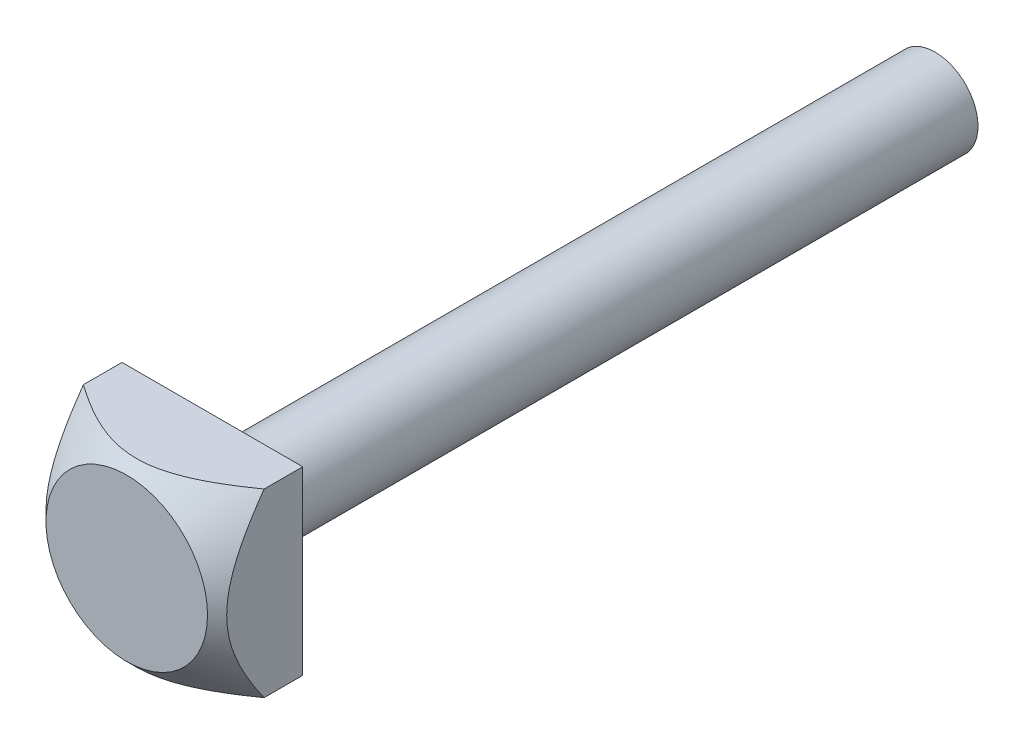
ISO-10303-21;
HEADER;
FILE_DESCRIPTION(('STEP AP214'),'2;1');
FILE_NAME('part.step','',(''),(''),'','','');
FILE_SCHEMA(('AUTOMOTIVE_DESIGN { 1 0 10303 214 1 1 1 1 }'));
ENDSEC;
DATA;
#1=APPLICATION_CONTEXT('core data for automotive mechanical design processes');
#2=APPLICATION_PROTOCOL_DEFINITION('international standard','automotive_design',2000,#1);
#3=PRODUCT_CONTEXT('',#1,'mechanical');
#4=PRODUCT('Part','Part','',(#3));
#5=PRODUCT_RELATED_PRODUCT_CATEGORY('part','',(#4));
#6=PRODUCT_DEFINITION_FORMATION('','',#4);
#7=PRODUCT_DEFINITION_CONTEXT('part definition',#1,'design');
#8=PRODUCT_DEFINITION('design','',#6,#7);
#9=PRODUCT_DEFINITION_SHAPE('','',#8);
#10=(LENGTH_UNIT() NAMED_UNIT(*) SI_UNIT(.MILLI.,.METRE.));
#11=(NAMED_UNIT(*) PLANE_ANGLE_UNIT() SI_UNIT($,.RADIAN.));
#12=(NAMED_UNIT(*) SI_UNIT($,.STERADIAN.) SOLID_ANGLE_UNIT());
#13=UNCERTAINTY_MEASURE_WITH_UNIT(LENGTH_MEASURE(1.E-05),#10,'distance_accuracy_value','');
#14=(GEOMETRIC_REPRESENTATION_CONTEXT(3) GLOBAL_UNCERTAINTY_ASSIGNED_CONTEXT((#13)) GLOBAL_UNIT_ASSIGNED_CONTEXT((#10,
#11,#12)) REPRESENTATION_CONTEXT('',''));
#15=CARTESIAN_POINT('',(0.,0.,0.));
#16=DIRECTION('',(0.,0.,1.));
#17=DIRECTION('',(1.,0.,0.));
#18=AXIS2_PLACEMENT_3D('',#15,#16,#17);
#19=CARTESIAN_POINT('',(9.5,9.5,9.));
#20=DIRECTION('',(-1.,0.,0.));
#21=DIRECTION('',(0.,-1.,0.));
#22=AXIS2_PLACEMENT_3D('',#19,#20,#21);
#23=PLANE('',#22);
#24=CARTESIAN_POINT('',(9.50000000000001,-20.0417212673577,-4.68636817389557));
#25=CARTESIAN_POINT('',(9.50000000000001,-19.5923730732626,-4.28037837364364));
#26=CARTESIAN_POINT('',(9.50000000000001,-19.1418237299608,-3.87570858413714));
#27=CARTESIAN_POINT('',(9.50000000000001,-18.2376978651878,-3.06969887886567));
#28=CARTESIAN_POINT('',(9.50000000000001,-17.7841211215472,-2.66835921244345));
#29=CARTESIAN_POINT('',(9.50000000000001,-16.8720031883656,-1.86855095707584));
#30=CARTESIAN_POINT('',(9.50000000000001,-16.4134511250011,-1.47009474209597));
#31=CARTESIAN_POINT('',(9.50000000000001,-15.7223155615848,-0.876280826702846));
#32=CARTESIAN_POINT('',(9.50000000000001,-15.4913906384999,-0.678991990434979));
#33=CARTESIAN_POINT('',(9.50000000000001,-15.0283016212763,-0.285861598052675));
#34=CARTESIAN_POINT('',(9.50000000000001,-14.7961374940735,-0.0900200808912309));
#35=CARTESIAN_POINT('',(9.50000000000001,-14.0710011341802,0.517328398598816));
#36=CARTESIAN_POINT('',(9.50000000000001,-13.5756516886263,0.926006598518927));
#37=CARTESIAN_POINT('',(9.50000000000001,-12.5772092371001,1.73379416928092));
#38=CARTESIAN_POINT('',(9.50000000000001,-12.0741165880928,2.13290397907304));
#39=CARTESIAN_POINT('',(9.50000000000001,-11.3122650680949,2.72160569149936));
#40=CARTESIAN_POINT('',(9.50000000000001,-11.0572669833382,2.91606587317929));
#41=CARTESIAN_POINT('',(9.50000000000001,-10.5444051579691,3.30116549587683));
#42=CARTESIAN_POINT('',(9.50000000000001,-10.2865414826739,3.49180502370452));
#43=CARTESIAN_POINT('',(9.50000000000001,-9.76757685769606,3.86853513115214));
#44=CARTESIAN_POINT('',(9.50000000000001,-9.50647649051677,4.05462651188485));
#45=CARTESIAN_POINT('',(9.50000000000001,-8.98051949311415,4.42141197260792));
#46=CARTESIAN_POINT('',(9.50000000000001,-8.71566305074137,4.60210632112299));
#47=CARTESIAN_POINT('',(9.50000000000001,-8.23865203650719,4.91910122285019));
#48=CARTESIAN_POINT('',(9.50000000000001,-8.02732198236332,5.05664143538501));
#49=CARTESIAN_POINT('',(9.50000000000001,-7.60167924408506,5.32704021975822));
#50=CARTESIAN_POINT('',(9.50000000000001,-7.38736654747647,5.45989877200845));
#51=CARTESIAN_POINT('',(9.50000000000001,-6.95531735478461,5.72020492974797));
#52=CARTESIAN_POINT('',(9.50000000000001,-6.73757912857458,5.84764967226628));
#53=CARTESIAN_POINT('',(9.50000000000001,-6.29844740802339,6.09608818753819));
#54=CARTESIAN_POINT('',(9.50000000000001,-6.07705394925149,6.2170820230175));
#55=CARTESIAN_POINT('',(9.50000000000001,-5.63229743444904,6.45039390905836));
#56=CARTESIAN_POINT('',(9.50000000000001,-5.40897105047448,6.56278133602902));
#57=CARTESIAN_POINT('',(9.50000000000001,-4.95810958542703,6.77873343132443));
#58=CARTESIAN_POINT('',(9.5,-4.73057426954477,6.88229760559672));
#59=CARTESIAN_POINT('',(9.5,-4.04160428518241,7.17727645788981));
#60=CARTESIAN_POINT('',(9.5,-3.57324034393485,7.35328242334376));
#61=CARTESIAN_POINT('',(9.5,-2.81453367769527,7.58837087773008));
#62=CARTESIAN_POINT('',(9.5,-2.52985209976433,7.66581629419068));
#63=CARTESIAN_POINT('',(9.5,-1.95517851196994,7.79783353852228));
#64=CARTESIAN_POINT('',(9.5,-1.66518733338838,7.85240891554878));
#65=CARTESIAN_POINT('',(9.5,-1.08259026026116,7.93575719935647));
#66=CARTESIAN_POINT('',(9.5,-0.789998430807787,7.96462706005755));
#67=CARTESIAN_POINT('',(9.5,-0.203379047593805,7.99525178751732));
#68=CARTESIAN_POINT('',(9.5,0.0906484734933177,7.99700726849478));
#69=CARTESIAN_POINT('',(9.5,0.677646174202131,7.97329499537613));
#70=CARTESIAN_POINT('',(9.5,0.970616117628069,7.94782149695403));
#71=CARTESIAN_POINT('',(9.5,1.55313441508035,7.87112729305192));
#72=CARTESIAN_POINT('',(9.5,1.84268248312107,7.81990445091141));
#73=CARTESIAN_POINT('',(9.5,2.41794523834898,7.69407496321651));
#74=CARTESIAN_POINT('',(9.5,2.70363683115422,7.61936419609721));
#75=CARTESIAN_POINT('',(9.5,3.26892554369698,7.44985161876595));
#76=CARTESIAN_POINT('',(9.5,3.54852246051522,7.35504914073364));
#77=CARTESIAN_POINT('',(9.5,4.16080514241227,7.12637434325508));
#78=CARTESIAN_POINT('',(9.5,4.4919805219018,6.98848425549441));
#79=CARTESIAN_POINT('',(9.5,5.14544057278843,6.69288832489013));
#80=CARTESIAN_POINT('',(9.5,5.46772077689808,6.53517273854368));
#81=CARTESIAN_POINT('',(9.5,6.10468569318532,6.20384596505104));
#82=CARTESIAN_POINT('',(9.5,6.41935552402881,6.03020638777145));
#83=CARTESIAN_POINT('',(9.5,7.04144668065026,5.67058080458727));
#84=CARTESIAN_POINT('',(9.5,7.34886911068626,5.48459669626358));
#85=CARTESIAN_POINT('',(9.5,7.96181726081544,5.10006263673665));
#86=CARTESIAN_POINT('',(9.5,8.26725422846057,4.90137186866767));
#87=CARTESIAN_POINT('',(9.5,8.87266630104506,4.49584932687694));
#88=CARTESIAN_POINT('',(9.5,9.17264124242189,4.28901730994674));
#89=CARTESIAN_POINT('',(9.5,9.76758178967295,3.86898992266096));
#90=CARTESIAN_POINT('',(9.5,10.0625526889801,3.65580203211709));
#91=CARTESIAN_POINT('',(9.5,10.5020047179397,3.3319711139773));
#92=CARTESIAN_POINT('',(9.5,10.647985779558,3.22335433375976));
#93=CARTESIAN_POINT('',(9.5,10.9390211991308,3.00488713429763));
#94=CARTESIAN_POINT('',(9.5,11.0840755603428,2.89503671939321));
#95=CARTESIAN_POINT('',(9.5,11.598362388142,2.50242101659101));
#96=CARTESIAN_POINT('',(9.5,11.9652307132791,2.2165547558364));
#97=CARTESIAN_POINT('',(9.5,12.694350502993,1.63898491563494));
#98=CARTESIAN_POINT('',(9.5,13.0566017794365,1.34728109955894));
#99=CARTESIAN_POINT('',(9.5,13.7772946167739,0.759102012225014));
#100=CARTESIAN_POINT('',(9.5,14.1357356035713,0.462626038401692));
#101=CARTESIAN_POINT('',(9.5,14.8493619613434,-0.134203824340193));
#102=CARTESIAN_POINT('',(9.5,15.2045473724905,-0.43455766529728));
#103=CARTESIAN_POINT('',(9.5,15.9123357606024,-1.03863661193217));
#104=CARTESIAN_POINT('',(9.5,16.2649373974988,-1.34236328627187));
#105=CARTESIAN_POINT('',(9.5,16.9677851688788,-1.95253144930041));
#106=CARTESIAN_POINT('',(9.5,17.3180312879615,-2.25897295570917));
#107=CARTESIAN_POINT('',(9.5,18.3657602928997,-3.18173807105576));
#108=CARTESIAN_POINT('',(9.5,19.060222788712,-3.8014928086164));
#109=CARTESIAN_POINT('',(9.5,20.098133685983,-4.73685527463836));
#110=CARTESIAN_POINT('',(9.5,20.4438566470177,-5.04994992476554));
#111=CARTESIAN_POINT('',(9.5,21.1339535807354,-5.67761360105597));
#112=CARTESIAN_POINT('',(9.5,21.4783275723584,-5.99218260638169));
#113=CARTESIAN_POINT('',(9.5,22.5097003541093,-6.93782679857949));
#114=CARTESIAN_POINT('',(9.5,23.1949351600908,-7.57082580183782));
#115=CARTESIAN_POINT('',(9.5,24.5615024765893,-8.84059495628473));
#116=CARTESIAN_POINT('',(9.5,25.2428361271386,-9.47736388216803));
#117=CARTESIAN_POINT('',(9.5,26.6025435816977,-10.7540448270886));
#118=CARTESIAN_POINT('',(9.5,27.2809174016513,-11.3939568291555));
#119=CARTESIAN_POINT('',(9.5,29.1393573153453,-13.1535702066372));
#120=CARTESIAN_POINT('',(9.5,30.3169877299625,-14.2758433928479));
#121=CARTESIAN_POINT('',(9.5,32.6671742157751,-16.5258992920477));
#122=CARTESIAN_POINT('',(9.5,33.8397298081081,-17.6536825044739));
#123=CARTESIAN_POINT('',(9.5,36.1765260919345,-19.9089275817975));
#124=CARTESIAN_POINT('',(9.5,37.3407814397396,-21.0363742665459));
#125=CARTESIAN_POINT('',(9.5,39.0849191470923,-22.7297361612328));
#126=CARTESIAN_POINT('',(9.5,39.6658945154198,-23.294526503131));
#127=CARTESIAN_POINT('',(9.5,40.8271984919451,-24.4247709198994));
#128=CARTESIAN_POINT('',(9.5,41.4075271006064,-24.9902249942935));
#129=CARTESIAN_POINT('',(9.5,41.9875736026911,-25.5559683525961));
#130=B_SPLINE_CURVE_WITH_KNOTS('',3,(#24,#25,#26,#27,#28,#29,#30,#31,#32,#33,#34,#35,#36,#37,
#38,#39,#40,#41,#42,#43,#44,#45,#46,#47,#48,#49,#50,#51,#52,#53,#54,#55,#56,#57,#58,#59,#60,#61,
#62,#63,#64,#65,#66,#67,#68,#69,#70,#71,#72,#73,#74,#75,#76,#77,#78,#79,#80,#81,#82,#83,#84,#85,
#86,#87,#88,#89,#90,#91,#92,#93,#94,#95,#96,#97,#98,#99,#100,#101,#102,#103,#104,#105,#106,#107,
#108,#109,#110,#111,#112,#113,#114,#115,#116,#117,#118,#119,#120,#121,#122,#123,#124,#125,#126,
#127,#128,#129),.UNSPECIFIED.,.F.,.F.,(4,2,2,2,2,2,2,2,2,2,2,2,2,2,2,2,2,2,2,2,2,2,2,2,2,2,2,2,
2,2,2,2,2,2,2,2,2,2,2,2,2,2,2,2,2,2,2,2,2,2,2,2,4),(0.,1.81678200141745,3.63369882851048,
5.45611746694714,6.36728884188256,7.27848465132521,9.20492404637271,11.1312748961779,
12.0933013692795,13.0553059590875,14.0171398615981,14.9789258288997,15.7353129435926,
16.4917032226469,17.2484886447631,18.0052667068971,18.755105852599,19.5049869575123,
21.0028276694774,21.8871513171501,22.771337677543,23.6521748353672,24.5329920396639,
25.41399510109,26.2950712795356,27.1801096760423,28.0651774946023,29.1405364824813,
30.2164260512677,31.2942725142247,32.3719536744116,33.4649207118284,34.5579204249268,
35.6496810295647,36.1955444964398,36.7414060434657,38.1366015822194,39.53185379116,
40.9273133252106,42.3227556167144,43.7188766232182,45.1150067490308,47.9073106224418,
49.3065845922539,50.7058388449493,53.504407142721,56.3021109644898,59.0997996972599,
63.9800174665321,68.8606861113948,73.7227396728183,76.1535178905231,78.5842943657068),.UNSPECIFIED.);
#131=CARTESIAN_POINT('',(9.50000000000001,-9.5,4.05788591512609));
#132=VERTEX_POINT('',#131);
#133=CARTESIAN_POINT('',(9.5,9.5,4.05788591512609));
#134=VERTEX_POINT('',#133);
#135=EDGE_CURVE('E76',#132,#134,#130,.T.);
#136=ORIENTED_EDGE('',*,*,#135,.F.);
#137=DIRECTION('',(0.,0.,-1.));
#138=VECTOR('',#137,1.);
#139=CARTESIAN_POINT('',(9.50000000000001,-9.5,9.));
#140=LINE('',#139,#138);
#141=CARTESIAN_POINT('',(9.50000000000001,-9.5,0.));
#142=VERTEX_POINT('',#141);
#143=EDGE_CURVE('E57',#132,#142,#140,.T.);
#144=ORIENTED_EDGE('',*,*,#143,.T.);
#145=DIRECTION('',(0.,1.,0.));
#146=VECTOR('',#145,1.);
#147=CARTESIAN_POINT('',(9.5,9.5,0.));
#148=LINE('',#147,#146);
#149=CARTESIAN_POINT('',(9.5,9.5,0.));
#150=VERTEX_POINT('',#149);
#151=EDGE_CURVE('E83',#142,#150,#148,.T.);
#152=ORIENTED_EDGE('',*,*,#151,.T.);
#153=DIRECTION('',(0.,0.,-1.));
#154=VECTOR('',#153,1.);
#155=CARTESIAN_POINT('',(9.5,9.5,9.));
#156=LINE('',#155,#154);
#157=EDGE_CURVE('E42',#134,#150,#156,.T.);
#158=ORIENTED_EDGE('',*,*,#157,.F.);
#159=EDGE_LOOP('',(#136,#144,#152,#158));
#160=FACE_BOUND('',#159,.T.);
#161=ADVANCED_FACE('F34',(#160),#23,.F.);
#162=CARTESIAN_POINT('',(-9.5,9.5,9.));
#163=DIRECTION('',(0.,-1.,0.));
#164=DIRECTION('',(1.,0.,0.));
#165=AXIS2_PLACEMENT_3D('',#162,#163,#164);
#166=PLANE('',#165);
#167=CARTESIAN_POINT('',(-20.0417212673573,9.5,-4.68636817389517));
#168=CARTESIAN_POINT('',(-19.5923730732622,9.5,-4.28037837364325));
#169=CARTESIAN_POINT('',(-19.1418237299604,9.5,-3.87570858413675));
#170=CARTESIAN_POINT('',(-18.2376978651874,9.5,-3.06969887886529));
#171=CARTESIAN_POINT('',(-17.7841211215468,9.5,-2.66835921244308));
#172=CARTESIAN_POINT('',(-16.8720031883652,9.5,-1.86855095707549));
#173=CARTESIAN_POINT('',(-16.4134511250007,9.5,-1.47009474209563));
#174=CARTESIAN_POINT('',(-15.7223155615844,9.5,-0.876280826702511));
#175=CARTESIAN_POINT('',(-15.4913906384995,9.5,-0.678991990434647));
#176=CARTESIAN_POINT('',(-15.0283016212759,9.5,-0.28586159805235));
#177=CARTESIAN_POINT('',(-14.7961374940731,9.5,-0.0900200808909085));
#178=CARTESIAN_POINT('',(-14.0710011341798,9.5,0.517328398599129));
#179=CARTESIAN_POINT('',(-13.5756516886259,9.5,0.926006598519232));
#180=CARTESIAN_POINT('',(-12.5772092370997,9.5,1.73379416928121));
#181=CARTESIAN_POINT('',(-12.0741165880924,9.5,2.13290397907333));
#182=CARTESIAN_POINT('',(-11.3122650680946,9.5,2.72160569149964));
#183=CARTESIAN_POINT('',(-11.0572669833379,9.5,2.91606587317956));
#184=CARTESIAN_POINT('',(-10.5444051579687,9.5,3.30116549587709));
#185=CARTESIAN_POINT('',(-10.2865414826736,9.5,3.49180502370478));
#186=CARTESIAN_POINT('',(-9.76757685769572,9.5,3.86853513115238));
#187=CARTESIAN_POINT('',(-9.50647649051643,9.5,4.05462651188509));
#188=CARTESIAN_POINT('',(-8.98051949311381,9.5,4.42141197260815));
#189=CARTESIAN_POINT('',(-8.71566305074103,9.5,4.60210632112322));
#190=CARTESIAN_POINT('',(-8.23865203650687,9.5,4.91910122285041));
#191=CARTESIAN_POINT('',(-8.02732198236301,9.5,5.05664143538522));
#192=CARTESIAN_POINT('',(-7.60167924408477,9.5,5.3270402197584));
#193=CARTESIAN_POINT('',(-7.38736654747619,9.5,5.45989877200862));
#194=CARTESIAN_POINT('',(-6.95531735478436,9.5,5.72020492974813));
#195=CARTESIAN_POINT('',(-6.73757912857434,9.5,5.84764967226642));
#196=CARTESIAN_POINT('',(-6.29844740802317,9.5,6.09608818753832));
#197=CARTESIAN_POINT('',(-6.07705394925127,9.5,6.21708202301762));
#198=CARTESIAN_POINT('',(-5.63229743444884,9.5,6.45039390905846));
#199=CARTESIAN_POINT('',(-5.4089710504743,9.5,6.56278133602911));
#200=CARTESIAN_POINT('',(-4.95810958542687,9.5,6.7787334313245));
#201=CARTESIAN_POINT('',(-4.73057426954462,9.5,6.88229760559679));
#202=CARTESIAN_POINT('',(-4.0416042851823,9.5,7.17727645788985));
#203=CARTESIAN_POINT('',(-3.57324034393476,9.5,7.35328242334379));
#204=CARTESIAN_POINT('',(-2.81453367769522,9.5,7.5883708777301));
#205=CARTESIAN_POINT('',(-2.52985209976428,9.5,7.6658162941907));
#206=CARTESIAN_POINT('',(-1.95517851196989,9.5,7.79783353852229));
#207=CARTESIAN_POINT('',(-1.66518733338834,9.5,7.85240891554879));
#208=CARTESIAN_POINT('',(-1.08259026026112,9.5,7.93575719935647));
#209=CARTESIAN_POINT('',(-0.789998430807752,9.5,7.96462706005756));
#210=CARTESIAN_POINT('',(-0.203379047593777,9.5,7.99525178751732));
#211=CARTESIAN_POINT('',(0.0906484734933427,9.5,7.99700726849478));
#212=CARTESIAN_POINT('',(0.67764617420215,9.5,7.97329499537613));
#213=CARTESIAN_POINT('',(0.970616117628086,9.5,7.94782149695403));
#214=CARTESIAN_POINT('',(1.55313441508036,9.5,7.87112729305193));
#215=CARTESIAN_POINT('',(1.84268248312107,9.5,7.81990445091141));
#216=CARTESIAN_POINT('',(2.41794523834898,9.5,7.69407496321651));
#217=CARTESIAN_POINT('',(2.70363683115422,9.5,7.61936419609721));
#218=CARTESIAN_POINT('',(3.26892554369697,9.5,7.44985161876596));
#219=CARTESIAN_POINT('',(3.54852246051521,9.5,7.35504914073365));
#220=CARTESIAN_POINT('',(4.16080514241226,9.5,7.12637434325509));
#221=CARTESIAN_POINT('',(4.49198052190178,9.5,6.98848425549442));
#222=CARTESIAN_POINT('',(5.14544057278841,9.5,6.69288832489014));
#223=CARTESIAN_POINT('',(5.46772077689806,9.5,6.53517273854369));
#224=CARTESIAN_POINT('',(6.10468569318529,9.5,6.20384596505106));
#225=CARTESIAN_POINT('',(6.41935552402878,9.5,6.03020638777146));
#226=CARTESIAN_POINT('',(7.04144668065023,9.5,5.67058080458728));
#227=CARTESIAN_POINT('',(7.34886911068623,9.5,5.48459669626361));
#228=CARTESIAN_POINT('',(7.96181726081541,9.5,5.10006263673667));
#229=CARTESIAN_POINT('',(8.26725422846053,9.5,4.9013718686677));
#230=CARTESIAN_POINT('',(8.87266630104502,9.5,4.49584932687697));
#231=CARTESIAN_POINT('',(9.17264124242186,9.5,4.28901730994676));
#232=CARTESIAN_POINT('',(9.76758178967292,9.5,3.86898992266099));
#233=CARTESIAN_POINT('',(10.06255268898,9.5,3.65580203211712));
#234=CARTESIAN_POINT('',(10.5020047179396,9.5,3.33197111397733));
#235=CARTESIAN_POINT('',(10.6479857795579,9.5,3.22335433375979));
#236=CARTESIAN_POINT('',(10.9390211991307,9.5,3.00488713429767));
#237=CARTESIAN_POINT('',(11.0840755603428,9.5,2.89503671939325));
#238=CARTESIAN_POINT('',(11.5983623881419,9.5,2.50242101659104));
#239=CARTESIAN_POINT('',(11.965230713279,9.5,2.21655475583643));
#240=CARTESIAN_POINT('',(12.694350502993,9.5,1.63898491563497));
#241=CARTESIAN_POINT('',(13.0566017794364,9.5,1.34728109955898));
#242=CARTESIAN_POINT('',(13.7772946167739,9.5,0.75910201222505));
#243=CARTESIAN_POINT('',(14.1357356035712,9.5,0.462626038401725));
#244=CARTESIAN_POINT('',(14.8493619613434,9.5,-0.13420382434016));
#245=CARTESIAN_POINT('',(15.2045473724905,9.5,-0.434557665297247));
#246=CARTESIAN_POINT('',(15.9123357606024,9.5,-1.03863661193214));
#247=CARTESIAN_POINT('',(16.2649373974988,9.5,-1.34236328627184));
#248=CARTESIAN_POINT('',(16.9677851688788,9.5,-1.95253144930038));
#249=CARTESIAN_POINT('',(17.3180312879615,9.5,-2.25897295570914));
#250=CARTESIAN_POINT('',(18.3657602928997,9.5,-3.18173807105573));
#251=CARTESIAN_POINT('',(19.060222788712,9.5,-3.80149280861636));
#252=CARTESIAN_POINT('',(20.0981336859829,9.5,-4.73685527463833));
#253=CARTESIAN_POINT('',(20.4438566470176,9.5,-5.04994992476551));
#254=CARTESIAN_POINT('',(21.1339535807354,9.5,-5.67761360105594));
#255=CARTESIAN_POINT('',(21.4783275723584,9.5,-5.99218260638165));
#256=CARTESIAN_POINT('',(22.5097003541093,9.5,-6.93782679857945));
#257=CARTESIAN_POINT('',(23.1949351600908,9.5,-7.57082580183779));
#258=CARTESIAN_POINT('',(24.5615024765893,9.5,-8.8405949562847));
#259=CARTESIAN_POINT('',(25.2428361271385,9.5,-9.477363882168));
#260=CARTESIAN_POINT('',(26.6025435816977,9.5,-10.7540448270885));
#261=CARTESIAN_POINT('',(27.2809174016512,9.5,-11.3939568291555));
#262=CARTESIAN_POINT('',(29.1393573153452,9.5,-13.1535702066372));
#263=CARTESIAN_POINT('',(30.3169877299624,9.5,-14.2758433928479));
#264=CARTESIAN_POINT('',(32.667174215775,9.5,-16.5258992920477));
#265=CARTESIAN_POINT('',(33.8397298081081,9.5,-17.6536825044739));
#266=CARTESIAN_POINT('',(36.1765260919344,9.5,-19.9089275817975));
#267=CARTESIAN_POINT('',(37.3407814397396,9.50000000000001,-21.0363742665458));
#268=CARTESIAN_POINT('',(39.0849191470923,9.50000000000001,-22.7297361612328));
#269=CARTESIAN_POINT('',(39.6658945154197,9.50000000000001,-23.2945265031309));
#270=CARTESIAN_POINT('',(40.8271984919451,9.50000000000001,-24.4247709198993));
#271=CARTESIAN_POINT('',(41.4075271006063,9.50000000000001,-24.9902249942935));
#272=CARTESIAN_POINT('',(41.9875736026911,9.50000000000001,-25.5559683525961));
#273=B_SPLINE_CURVE_WITH_KNOTS('',3,(#167,#168,#169,#170,#171,#172,#173,#174,#175,#176,#177,
#178,#179,#180,#181,#182,#183,#184,#185,#186,#187,#188,#189,#190,#191,#192,#193,#194,#195,#196,
#197,#198,#199,#200,#201,#202,#203,#204,#205,#206,#207,#208,#209,#210,#211,#212,#213,#214,#215,
#216,#217,#218,#219,#220,#221,#222,#223,#224,#225,#226,#227,#228,#229,#230,#231,#232,#233,#234,
#235,#236,#237,#238,#239,#240,#241,#242,#243,#244,#245,#246,#247,#248,#249,#250,#251,#252,#253,
#254,#255,#256,#257,#258,#259,#260,#261,#262,#263,#264,#265,#266,#267,#268,#269,#270,#271,#272),
.UNSPECIFIED.,.F.,.F.,(4,2,2,2,2,2,2,2,2,2,2,2,2,2,2,2,2,2,2,2,2,2,2,2,2,2,2,2,2,2,2,2,2,2,2,2,
2,2,2,2,2,2,2,2,2,2,2,2,2,2,2,2,4),(0.,1.81678200141742,3.63369882851043,5.45611746694706,
6.36728884188247,7.2784846513251,9.20492404637259,11.1312748961777,12.0933013692793,
13.0553059590873,14.0171398615979,14.9789258288995,15.7353129435923,16.4917032226466,
17.2484886447627,18.0052667068967,18.7551058525986,19.5049869575119,21.0028276694769,
21.8871513171495,22.7713376775424,23.6521748353667,24.5329920396633,25.4139951010894,
26.295071279535,27.1801096760417,28.0651774946017,29.1405364824807,30.2164260512671,
31.2942725142241,32.3719536744109,33.4649207118278,34.5579204249261,35.6496810295641,
36.1955444964391,36.7414060434651,38.1366015822187,39.5318537911594,40.92731332521,
42.3227556167137,43.7188766232175,45.1150067490301,47.9073106224412,49.3065845922532,
50.7058388449487,53.5044071427204,56.3021109644892,59.0997996972592,63.9800174665315,
68.8606861113942,73.7227396728177,76.1535178905225,78.5842943657062),.UNSPECIFIED.);
#274=CARTESIAN_POINT('',(-9.5,9.5,4.05788591512609));
#275=VERTEX_POINT('',#274);
#276=EDGE_CURVE('E84',#134,#275,#273,.F.);
#277=ORIENTED_EDGE('',*,*,#276,.F.);
#278=ORIENTED_EDGE('',*,*,#157,.T.);
#279=DIRECTION('',(-1.,0.,0.));
#280=VECTOR('',#279,1.);
#281=CARTESIAN_POINT('',(-9.5,9.5,0.));
#282=LINE('',#281,#280);
#283=CARTESIAN_POINT('',(-9.5,9.5,0.));
#284=VERTEX_POINT('',#283);
#285=EDGE_CURVE('E103',#150,#284,#282,.T.);
#286=ORIENTED_EDGE('',*,*,#285,.T.);
#287=DIRECTION('',(0.,0.,-1.));
#288=VECTOR('',#287,1.);
#289=CARTESIAN_POINT('',(-9.5,9.5,9.));
#290=LINE('',#289,#288);
#291=EDGE_CURVE('E92',#275,#284,#290,.T.);
#292=ORIENTED_EDGE('',*,*,#291,.F.);
#293=EDGE_LOOP('',(#277,#278,#286,#292));
#294=FACE_BOUND('',#293,.T.);
#295=ADVANCED_FACE('F101',(#294),#166,.F.);
#296=CARTESIAN_POINT('',(-9.5,9.5,9.));
#297=DIRECTION('',(1.,0.,0.));
#298=DIRECTION('',(0.,1.,0.));
#299=AXIS2_PLACEMENT_3D('',#296,#297,#298);
#300=PLANE('',#299);
#301=CARTESIAN_POINT('',(-9.49999999999999,-20.0417212673573,-4.68636817389516));
#302=CARTESIAN_POINT('',(-9.49999999999999,-19.5923730732622,-4.28037837364324));
#303=CARTESIAN_POINT('',(-9.49999999999999,-19.1418237299604,-3.87570858413674));
#304=CARTESIAN_POINT('',(-9.49999999999999,-18.2376978651874,-3.06969887886528));
#305=CARTESIAN_POINT('',(-9.49999999999999,-17.7841211215468,-2.66835921244307));
#306=CARTESIAN_POINT('',(-9.49999999999999,-16.8720031883652,-1.86855095707548));
#307=CARTESIAN_POINT('',(-9.49999999999999,-16.4134511250007,-1.47009474209562));
#308=CARTESIAN_POINT('',(-9.49999999999999,-15.7223155615844,-0.876280826702501));
#309=CARTESIAN_POINT('',(-9.49999999999999,-15.4913906384995,-0.678991990434635));
#310=CARTESIAN_POINT('',(-9.49999999999999,-15.0283016212759,-0.285861598052337));
#311=CARTESIAN_POINT('',(-9.49999999999999,-14.7961374940731,-0.0900200808908978));
#312=CARTESIAN_POINT('',(-9.49999999999999,-14.0710011341798,0.517328398599137));
#313=CARTESIAN_POINT('',(-9.49999999999999,-13.5756516886259,0.926006598519242));
#314=CARTESIAN_POINT('',(-9.49999999999999,-12.5772092370997,1.73379416928122));
#315=CARTESIAN_POINT('',(-9.49999999999999,-12.0741165880924,2.13290397907334));
#316=CARTESIAN_POINT('',(-9.49999999999999,-11.3122650680946,2.72160569149965));
#317=CARTESIAN_POINT('',(-9.49999999999999,-11.0572669833378,2.91606587317956));
#318=CARTESIAN_POINT('',(-9.49999999999999,-10.5444051579687,3.3011654958771));
#319=CARTESIAN_POINT('',(-9.49999999999999,-10.2865414826736,3.49180502370479));
#320=CARTESIAN_POINT('',(-9.49999999999999,-9.76757685769572,3.86853513115239));
#321=CARTESIAN_POINT('',(-9.49999999999999,-9.50647649051643,4.0546265118851));
#322=CARTESIAN_POINT('',(-9.49999999999999,-8.98051949311381,4.42141197260816));
#323=CARTESIAN_POINT('',(-9.49999999999999,-8.71566305074103,4.60210632112322));
#324=CARTESIAN_POINT('',(-9.49999999999999,-8.23865203650687,4.91910122285041));
#325=CARTESIAN_POINT('',(-9.49999999999999,-8.02732198236301,5.05664143538522));
#326=CARTESIAN_POINT('',(-9.49999999999999,-7.60167924408477,5.3270402197584));
#327=CARTESIAN_POINT('',(-9.49999999999999,-7.3873665474762,5.45989877200862));
#328=CARTESIAN_POINT('',(-9.49999999999999,-6.95531735478436,5.72020492974813));
#329=CARTESIAN_POINT('',(-9.49999999999999,-6.73757912857434,5.84764967226643));
#330=CARTESIAN_POINT('',(-9.49999999999999,-6.29844740802317,6.09608818753832));
#331=CARTESIAN_POINT('',(-9.5,-6.07705394925128,6.21708202301762));
#332=CARTESIAN_POINT('',(-9.5,-5.63229743444885,6.45039390905847));
#333=CARTESIAN_POINT('',(-9.5,-5.4089710504743,6.56278133602912));
#334=CARTESIAN_POINT('',(-9.5,-4.95810958542687,6.77873343132451));
#335=CARTESIAN_POINT('',(-9.5,-4.73057426954462,6.88229760559679));
#336=CARTESIAN_POINT('',(-9.5,-4.0416042851823,7.17727645788985));
#337=CARTESIAN_POINT('',(-9.5,-3.57324034393476,7.35328242334379));
#338=CARTESIAN_POINT('',(-9.5,-2.81453367769522,7.5883708777301));
#339=CARTESIAN_POINT('',(-9.5,-2.52985209976428,7.6658162941907));
#340=CARTESIAN_POINT('',(-9.5,-1.9551785119699,7.7978335385223));
#341=CARTESIAN_POINT('',(-9.5,-1.66518733338834,7.8524089155488));
#342=CARTESIAN_POINT('',(-9.5,-1.08259026026113,7.93575719935648));
#343=CARTESIAN_POINT('',(-9.5,-0.789998430807752,7.96462706005756));
#344=CARTESIAN_POINT('',(-9.5,-0.203379047593778,7.99525178751732));
#345=CARTESIAN_POINT('',(-9.5,0.0906484734933402,7.99700726849478));
#346=CARTESIAN_POINT('',(-9.5,0.677646174202146,7.97329499537614));
#347=CARTESIAN_POINT('',(-9.5,0.970616117628082,7.94782149695403));
#348=CARTESIAN_POINT('',(-9.5,1.55313441508036,7.87112729305193));
#349=CARTESIAN_POINT('',(-9.5,1.84268248312107,7.81990445091141));
#350=CARTESIAN_POINT('',(-9.5,2.41794523834898,7.69407496321652));
#351=CARTESIAN_POINT('',(-9.5,2.70363683115422,7.61936419609721));
#352=CARTESIAN_POINT('',(-9.5,3.26892554369697,7.44985161876596));
#353=CARTESIAN_POINT('',(-9.5,3.5485224605152,7.35504914073365));
#354=CARTESIAN_POINT('',(-9.5,4.16080514241225,7.12637434325509));
#355=CARTESIAN_POINT('',(-9.5,4.49198052190178,6.98848425549443));
#356=CARTESIAN_POINT('',(-9.5,5.1454405727884,6.69288832489014));
#357=CARTESIAN_POINT('',(-9.5,5.46772077689805,6.5351727385437));
#358=CARTESIAN_POINT('',(-9.5,6.10468569318528,6.20384596505106));
#359=CARTESIAN_POINT('',(-9.5,6.41935552402877,6.03020638777147));
#360=CARTESIAN_POINT('',(-9.5,7.04144668065022,5.67058080458729));
#361=CARTESIAN_POINT('',(-9.5,7.34886911068621,5.48459669626361));
#362=CARTESIAN_POINT('',(-9.5,7.9618172608154,5.10006263673668));
#363=CARTESIAN_POINT('',(-9.5,8.26725422846051,4.90137186866771));
#364=CARTESIAN_POINT('',(-9.5,8.87266630104501,4.49584932687698));
#365=CARTESIAN_POINT('',(-9.5,9.17264124242184,4.28901730994678));
#366=CARTESIAN_POINT('',(-9.5,9.7675817896729,3.86898992266101));
#367=CARTESIAN_POINT('',(-9.5,10.06255268898,3.65580203211714));
#368=CARTESIAN_POINT('',(-9.5,10.5020047179396,3.33197111397735));
#369=CARTESIAN_POINT('',(-9.5,10.6479857795579,3.2233543337598));
#370=CARTESIAN_POINT('',(-9.5,10.9390211991307,3.00488713429768));
#371=CARTESIAN_POINT('',(-9.5,11.0840755603427,2.89503671939326));
#372=CARTESIAN_POINT('',(-9.5,11.5983623881419,2.50242101659106));
#373=CARTESIAN_POINT('',(-9.5,11.965230713279,2.21655475583645));
#374=CARTESIAN_POINT('',(-9.5,12.694350502993,1.63898491563499));
#375=CARTESIAN_POINT('',(-9.5,13.0566017794364,1.34728109955899));
#376=CARTESIAN_POINT('',(-9.5,13.7772946167739,0.759102012225066));
#377=CARTESIAN_POINT('',(-9.5,14.1357356035712,0.462626038401742));
#378=CARTESIAN_POINT('',(-9.5,14.8493619613433,-0.134203824340145));
#379=CARTESIAN_POINT('',(-9.5,15.2045473724904,-0.434557665297232));
#380=CARTESIAN_POINT('',(-9.5,15.9123357606024,-1.03863661193213));
#381=CARTESIAN_POINT('',(-9.5,16.2649373974988,-1.34236328627182));
#382=CARTESIAN_POINT('',(-9.5,16.9677851688788,-1.95253144930036));
#383=CARTESIAN_POINT('',(-9.5,17.3180312879615,-2.25897295570912));
#384=CARTESIAN_POINT('',(-9.5,18.3657602928997,-3.18173807105571));
#385=CARTESIAN_POINT('',(-9.5,19.060222788712,-3.80149280861635));
#386=CARTESIAN_POINT('',(-9.5,20.0981336859829,-4.73685527463832));
#387=CARTESIAN_POINT('',(-9.5,20.4438566470176,-5.0499499247655));
#388=CARTESIAN_POINT('',(-9.5,21.1339535807354,-5.67761360105593));
#389=CARTESIAN_POINT('',(-9.5,21.4783275723584,-5.99218260638164));
#390=CARTESIAN_POINT('',(-9.5,22.5097003541093,-6.93782679857943));
#391=CARTESIAN_POINT('',(-9.5,23.1949351600908,-7.57082580183778));
#392=CARTESIAN_POINT('',(-9.5,24.5615024765892,-8.84059495628468));
#393=CARTESIAN_POINT('',(-9.50000000000001,25.2428361271385,-9.47736388216798));
#394=CARTESIAN_POINT('',(-9.50000000000001,26.6025435816977,-10.7540448270885));
#395=CARTESIAN_POINT('',(-9.50000000000001,27.2809174016512,-11.3939568291554));
#396=CARTESIAN_POINT('',(-9.50000000000001,29.1393573153452,-13.1535702066371));
#397=CARTESIAN_POINT('',(-9.50000000000001,30.3169877299624,-14.2758433928479));
#398=CARTESIAN_POINT('',(-9.50000000000001,32.667174215775,-16.5258992920476));
#399=CARTESIAN_POINT('',(-9.50000000000001,33.8397298081081,-17.6536825044738));
#400=CARTESIAN_POINT('',(-9.50000000000001,36.1765260919344,-19.9089275817975));
#401=CARTESIAN_POINT('',(-9.50000000000001,37.3407814397395,-21.0363742665458));
#402=CARTESIAN_POINT('',(-9.50000000000001,39.0849191470923,-22.7297361612327));
#403=CARTESIAN_POINT('',(-9.50000000000001,39.6658945154197,-23.2945265031309));
#404=CARTESIAN_POINT('',(-9.50000000000001,40.827198491945,-24.4247709198993));
#405=CARTESIAN_POINT('',(-9.50000000000001,41.4075271006063,-24.9902249942934));
#406=CARTESIAN_POINT('',(-9.50000000000001,41.9875736026911,-25.555968352596));
#407=B_SPLINE_CURVE_WITH_KNOTS('',3,(#301,#302,#303,#304,#305,#306,#307,#308,#309,#310,#311,
#312,#313,#314,#315,#316,#317,#318,#319,#320,#321,#322,#323,#324,#325,#326,#327,#328,#329,#330,
#331,#332,#333,#334,#335,#336,#337,#338,#339,#340,#341,#342,#343,#344,#345,#346,#347,#348,#349,
#350,#351,#352,#353,#354,#355,#356,#357,#358,#359,#360,#361,#362,#363,#364,#365,#366,#367,#368,
#369,#370,#371,#372,#373,#374,#375,#376,#377,#378,#379,#380,#381,#382,#383,#384,#385,#386,#387,
#388,#389,#390,#391,#392,#393,#394,#395,#396,#397,#398,#399,#400,#401,#402,#403,#404,#405,#406),
.UNSPECIFIED.,.F.,.F.,(4,2,2,2,2,2,2,2,2,2,2,2,2,2,2,2,2,2,2,2,2,2,2,2,2,2,2,2,2,2,2,2,2,2,2,2,
2,2,2,2,2,2,2,2,2,2,2,2,2,2,2,2,4),(0.,1.81678200141742,3.63369882851043,5.45611746694706,
6.36728884188248,7.27848465132511,9.2049240463726,11.1312748961777,12.0933013692793,
13.0553059590873,14.0171398615979,14.9789258288995,15.7353129435923,16.4917032226466,
17.2484886447627,18.0052667068967,18.7551058525986,19.5049869575119,21.0028276694768,
21.8871513171495,22.7713376775424,23.6521748353666,24.5329920396633,25.4139951010894,
26.295071279535,27.1801096760417,28.0651774946017,29.1405364824807,30.216426051267,
31.2942725142241,32.3719536744109,33.4649207118277,34.5579204249261,35.649681029564,
36.1955444964391,36.741406043465,38.1366015822187,39.5318537911594,40.92731332521,
42.3227556167137,43.7188766232175,45.1150067490301,47.9073106224412,49.3065845922532,
50.7058388449486,53.5044071427203,56.3021109644892,59.0997996972592,63.9800174665315,
68.8606861113941,73.7227396728177,76.1535178905225,78.5842943657062),.UNSPECIFIED.);
#408=CARTESIAN_POINT('',(-9.49999999999999,-9.5,4.0578859151261));
#409=VERTEX_POINT('',#408);
#410=EDGE_CURVE('E49',#275,#409,#407,.F.);
#411=ORIENTED_EDGE('',*,*,#410,.F.);
#412=ORIENTED_EDGE('',*,*,#291,.T.);
#413=DIRECTION('',(0.,-1.,0.));
#414=VECTOR('',#413,1.);
#415=CARTESIAN_POINT('',(-9.5,9.5,0.));
#416=LINE('',#415,#414);
#417=CARTESIAN_POINT('',(-9.49999999999999,-9.5,0.));
#418=VERTEX_POINT('',#417);
#419=EDGE_CURVE('E94',#284,#418,#416,.T.);
#420=ORIENTED_EDGE('',*,*,#419,.T.);
#421=DIRECTION('',(0.,0.,-1.));
#422=VECTOR('',#421,1.);
#423=CARTESIAN_POINT('',(-9.49999999999999,-9.5,9.));
#424=LINE('',#423,#422);
#425=EDGE_CURVE('E90',#409,#418,#424,.T.);
#426=ORIENTED_EDGE('',*,*,#425,.F.);
#427=EDGE_LOOP('',(#411,#412,#420,#426));
#428=FACE_BOUND('',#427,.T.);
#429=ADVANCED_FACE('F116',(#428),#300,.F.);
#430=CARTESIAN_POINT('',(-9.49999999999999,-9.5,9.));
#431=DIRECTION('',(0.,1.,0.));
#432=DIRECTION('',(0.,0.,1.));
#433=AXIS2_PLACEMENT_3D('',#430,#431,#432);
#434=PLANE('',#433);
#435=CARTESIAN_POINT('',(-20.0417212673573,-9.5,-4.68636817389516));
#436=CARTESIAN_POINT('',(-19.5923730732622,-9.5,-4.28037837364325));
#437=CARTESIAN_POINT('',(-19.1418237299604,-9.5,-3.87570858413675));
#438=CARTESIAN_POINT('',(-18.2376978651874,-9.5,-3.06969887886529));
#439=CARTESIAN_POINT('',(-17.7841211215468,-9.5,-2.66835921244307));
#440=CARTESIAN_POINT('',(-16.8720031883652,-9.5,-1.86855095707548));
#441=CARTESIAN_POINT('',(-16.4134511250007,-9.5,-1.47009474209563));
#442=CARTESIAN_POINT('',(-15.7223155615844,-9.5,-0.876280826702507));
#443=CARTESIAN_POINT('',(-15.4913906384995,-9.5,-0.678991990434642));
#444=CARTESIAN_POINT('',(-15.0283016212759,-9.5,-0.285861598052343));
#445=CARTESIAN_POINT('',(-14.7961374940731,-9.5,-0.0900200808909023));
#446=CARTESIAN_POINT('',(-14.0710011341798,-9.5,0.517328398599135));
#447=CARTESIAN_POINT('',(-13.5756516886259,-9.5,0.926006598519239));
#448=CARTESIAN_POINT('',(-12.5772092370997,-9.5,1.73379416928122));
#449=CARTESIAN_POINT('',(-12.0741165880924,-9.5,2.13290397907333));
#450=CARTESIAN_POINT('',(-11.3122650680946,-9.5,2.72160569149964));
#451=CARTESIAN_POINT('',(-11.0572669833378,-9.5,2.91606587317956));
#452=CARTESIAN_POINT('',(-10.5444051579687,-9.5,3.3011654958771));
#453=CARTESIAN_POINT('',(-10.2865414826736,-9.5,3.49180502370479));
#454=CARTESIAN_POINT('',(-9.76757685769572,-9.5,3.86853513115239));
#455=CARTESIAN_POINT('',(-9.50647649051642,-9.5,4.0546265118851));
#456=CARTESIAN_POINT('',(-8.98051949311381,-9.5,4.42141197260816));
#457=CARTESIAN_POINT('',(-8.71566305074103,-9.5,4.60210632112322));
#458=CARTESIAN_POINT('',(-8.23865203650687,-9.5,4.91910122285041));
#459=CARTESIAN_POINT('',(-8.02732198236301,-9.5,5.05664143538522));
#460=CARTESIAN_POINT('',(-7.60167924408477,-9.5,5.3270402197584));
#461=CARTESIAN_POINT('',(-7.3873665474762,-9.5,5.45989877200862));
#462=CARTESIAN_POINT('',(-6.95531735478436,-9.5,5.72020492974813));
#463=CARTESIAN_POINT('',(-6.73757912857434,-9.5,5.84764967226643));
#464=CARTESIAN_POINT('',(-6.29844740802317,-9.5,6.09608818753832));
#465=CARTESIAN_POINT('',(-6.07705394925127,-9.5,6.21708202301762));
#466=CARTESIAN_POINT('',(-5.63229743444885,-9.5,6.45039390905847));
#467=CARTESIAN_POINT('',(-5.4089710504743,-9.5,6.56278133602912));
#468=CARTESIAN_POINT('',(-4.95810958542687,-9.5,6.77873343132451));
#469=CARTESIAN_POINT('',(-4.73057426954462,-9.5,6.88229760559679));
#470=CARTESIAN_POINT('',(-4.0416042851823,-9.5,7.17727645788985));
#471=CARTESIAN_POINT('',(-3.57324034393476,-9.5,7.35328242334379));
#472=CARTESIAN_POINT('',(-2.81453367769522,-9.5,7.5883708777301));
#473=CARTESIAN_POINT('',(-2.52985209976428,-9.5,7.6658162941907));
#474=CARTESIAN_POINT('',(-1.95517851196989,-9.5,7.79783353852229));
#475=CARTESIAN_POINT('',(-1.66518733338834,-9.5,7.8524089155488));
#476=CARTESIAN_POINT('',(-1.08259026026113,-9.5,7.93575719935647));
#477=CARTESIAN_POINT('',(-0.789998430807754,-9.5,7.96462706005756));
#478=CARTESIAN_POINT('',(-0.20337904759378,-9.5,7.99525178751732));
#479=CARTESIAN_POINT('',(0.0906484734933398,-9.5,7.99700726849478));
#480=CARTESIAN_POINT('',(0.677646174202147,-9.5,7.97329499537614));
#481=CARTESIAN_POINT('',(0.970616117628082,-9.5,7.94782149695403));
#482=CARTESIAN_POINT('',(1.55313441508036,-9.5,7.87112729305193));
#483=CARTESIAN_POINT('',(1.84268248312107,-9.5,7.81990445091141));
#484=CARTESIAN_POINT('',(2.41794523834898,-9.5,7.69407496321652));
#485=CARTESIAN_POINT('',(2.70363683115422,-9.5,7.61936419609722));
#486=CARTESIAN_POINT('',(3.26892554369697,-9.5,7.44985161876596));
#487=CARTESIAN_POINT('',(3.5485224605152,-9.5,7.35504914073365));
#488=CARTESIAN_POINT('',(4.16080514241225,-9.5,7.12637434325509));
#489=CARTESIAN_POINT('',(4.49198052190178,-9.5,6.98848425549443));
#490=CARTESIAN_POINT('',(5.1454405727884,-9.5,6.69288832489014));
#491=CARTESIAN_POINT('',(5.46772077689805,-9.5,6.5351727385437));
#492=CARTESIAN_POINT('',(6.10468569318528,-9.5,6.20384596505106));
#493=CARTESIAN_POINT('',(6.41935552402877,-9.5,6.03020638777147));
#494=CARTESIAN_POINT('',(7.04144668065022,-9.5,5.67058080458729));
#495=CARTESIAN_POINT('',(7.34886911068621,-9.5,5.48459669626362));
#496=CARTESIAN_POINT('',(7.96181726081539,-9.5,5.10006263673668));
#497=CARTESIAN_POINT('',(8.26725422846052,-9.5,4.90137186866771));
#498=CARTESIAN_POINT('',(8.87266630104501,-9.5,4.49584932687698));
#499=CARTESIAN_POINT('',(9.17264124242184,-9.5,4.28901730994678));
#500=CARTESIAN_POINT('',(9.7675817896729,-9.5,3.86898992266101));
#501=CARTESIAN_POINT('',(10.06255268898,-9.5,3.65580203211714));
#502=CARTESIAN_POINT('',(10.5020047179396,-9.5,3.33197111397735));
#503=CARTESIAN_POINT('',(10.6479857795579,-9.5,3.2233543337598));
#504=CARTESIAN_POINT('',(10.9390211991307,-9.5,3.00488713429768));
#505=CARTESIAN_POINT('',(11.0840755603427,-9.5,2.89503671939326));
#506=CARTESIAN_POINT('',(11.5983623881419,-9.5,2.50242101659106));
#507=CARTESIAN_POINT('',(11.965230713279,-9.5,2.21655475583646));
#508=CARTESIAN_POINT('',(12.6943505029929,-9.5,1.638984915635));
#509=CARTESIAN_POINT('',(13.0566017794364,-9.5,1.347281099559));
#510=CARTESIAN_POINT('',(13.7772946167739,-9.5,0.759102012225073));
#511=CARTESIAN_POINT('',(14.1357356035712,-9.5,0.462626038401751));
#512=CARTESIAN_POINT('',(14.8493619613433,-9.5,-0.134203824340133));
#513=CARTESIAN_POINT('',(15.2045473724904,-9.5,-0.434557665297221));
#514=CARTESIAN_POINT('',(15.9123357606024,-9.5,-1.03863661193212));
#515=CARTESIAN_POINT('',(16.2649373974988,-9.5,-1.34236328627181));
#516=CARTESIAN_POINT('',(16.9677851688788,-9.5,-1.95253144930036));
#517=CARTESIAN_POINT('',(17.3180312879615,-9.5,-2.25897295570911));
#518=CARTESIAN_POINT('',(18.3657602928996,-9.5,-3.18173807105571));
#519=CARTESIAN_POINT('',(19.060222788712,-9.5,-3.80149280861635));
#520=CARTESIAN_POINT('',(20.0981336859829,-9.5,-4.73685527463831));
#521=CARTESIAN_POINT('',(20.4438566470176,-9.5,-5.04994992476549));
#522=CARTESIAN_POINT('',(21.1339535807354,-9.5,-5.67761360105592));
#523=CARTESIAN_POINT('',(21.4783275723584,-9.5,-5.99218260638163));
#524=CARTESIAN_POINT('',(22.5097003541093,-9.5,-6.93782679857943));
#525=CARTESIAN_POINT('',(23.1949351600908,-9.5,-7.57082580183777));
#526=CARTESIAN_POINT('',(24.5615024765892,-9.5,-8.84059495628468));
#527=CARTESIAN_POINT('',(25.2428361271385,-9.5,-9.47736388216798));
#528=CARTESIAN_POINT('',(26.6025435816977,-9.5,-10.7540448270885));
#529=CARTESIAN_POINT('',(27.2809174016512,-9.5,-11.3939568291554));
#530=CARTESIAN_POINT('',(29.1393573153452,-9.5,-13.1535702066371));
#531=CARTESIAN_POINT('',(30.3169877299624,-9.5,-14.2758433928479));
#532=CARTESIAN_POINT('',(32.667174215775,-9.5,-16.5258992920476));
#533=CARTESIAN_POINT('',(33.839729808108,-9.5,-17.6536825044738));
#534=CARTESIAN_POINT('',(36.1765260919344,-9.5,-19.9089275817974));
#535=CARTESIAN_POINT('',(37.3407814397395,-9.5,-21.0363742665458));
#536=CARTESIAN_POINT('',(39.0849191470923,-9.5,-22.7297361612327));
#537=CARTESIAN_POINT('',(39.6658945154197,-9.5,-23.2945265031309));
#538=CARTESIAN_POINT('',(40.827198491945,-9.5,-24.4247709198993));
#539=CARTESIAN_POINT('',(41.4075271006063,-9.5,-24.9902249942934));
#540=CARTESIAN_POINT('',(41.9875736026911,-9.5,-25.555968352596));
#541=B_SPLINE_CURVE_WITH_KNOTS('',3,(#435,#436,#437,#438,#439,#440,#441,#442,#443,#444,#445,
#446,#447,#448,#449,#450,#451,#452,#453,#454,#455,#456,#457,#458,#459,#460,#461,#462,#463,#464,
#465,#466,#467,#468,#469,#470,#471,#472,#473,#474,#475,#476,#477,#478,#479,#480,#481,#482,#483,
#484,#485,#486,#487,#488,#489,#490,#491,#492,#493,#494,#495,#496,#497,#498,#499,#500,#501,#502,
#503,#504,#505,#506,#507,#508,#509,#510,#511,#512,#513,#514,#515,#516,#517,#518,#519,#520,#521,
#522,#523,#524,#525,#526,#527,#528,#529,#530,#531,#532,#533,#534,#535,#536,#537,#538,#539,#540),
.UNSPECIFIED.,.F.,.F.,(4,2,2,2,2,2,2,2,2,2,2,2,2,2,2,2,2,2,2,2,2,2,2,2,2,2,2,2,2,2,2,2,2,2,2,2,
2,2,2,2,2,2,2,2,2,2,2,2,2,2,2,2,4),(0.,1.81678200141742,3.63369882851043,5.45611746694706,
6.36728884188248,7.27848465132511,9.2049240463726,11.1312748961777,12.0933013692794,
13.0553059590873,14.0171398615979,14.9789258288995,15.7353129435923,16.4917032226466,
17.2484886447627,18.0052667068967,18.7551058525986,19.5049869575119,21.0028276694768,
21.8871513171495,22.7713376775424,23.6521748353666,24.5329920396633,25.4139951010894,
26.295071279535,27.1801096760417,28.0651774946017,29.1405364824807,30.216426051267,
31.2942725142241,32.3719536744109,33.4649207118277,34.5579204249261,35.6496810295641,
36.1955444964391,36.741406043465,38.1366015822187,39.5318537911593,40.9273133252099,
42.3227556167137,43.7188766232175,45.1150067490301,47.9073106224412,49.3065845922532,
50.7058388449486,53.5044071427203,56.3021109644891,59.0997996972592,63.9800174665314,
68.8606861113941,73.7227396728177,76.1535178905225,78.5842943657062),.UNSPECIFIED.);
#542=EDGE_CURVE('E74',#409,#132,#541,.T.);
#543=ORIENTED_EDGE('',*,*,#542,.F.);
#544=ORIENTED_EDGE('',*,*,#425,.T.);
#545=DIRECTION('',(1.,0.,0.));
#546=VECTOR('',#545,1.);
#547=CARTESIAN_POINT('',(-9.49999999999999,-9.5,0.));
#548=LINE('',#547,#546);
#549=EDGE_CURVE('E88',#418,#142,#548,.T.);
#550=ORIENTED_EDGE('',*,*,#549,.T.);
#551=ORIENTED_EDGE('',*,*,#143,.F.);
#552=EDGE_LOOP('',(#543,#544,#550,#551));
#553=FACE_BOUND('',#552,.T.);
#554=ADVANCED_FACE('F86',(#553),#434,.F.);
#555=CARTESIAN_POINT('',(0.,0.,0.));
#556=DIRECTION('',(0.,0.,1.));
#557=DIRECTION('',(1.,0.,0.));
#558=AXIS2_PLACEMENT_3D('',#555,#556,#557);
#559=PLANE('',#558);
#560=CARTESIAN_POINT('',(0.,0.,0.));
#561=DIRECTION('',(0.,0.,1.));
#562=DIRECTION('',(1.,0.,0.));
#563=AXIS2_PLACEMENT_3D('',#560,#561,#562);
#564=CIRCLE('',#563,4.5);
#565=CARTESIAN_POINT('',(4.5,0.,0.));
#566=VERTEX_POINT('',#565);
#567=EDGE_CURVE('E12',#566,#566,#564,.F.);
#568=ORIENTED_EDGE('',*,*,#567,.F.);
#569=EDGE_LOOP('',(#568));
#570=FACE_BOUND('',#569,.T.);
#571=ORIENTED_EDGE('',*,*,#151,.F.);
#572=ORIENTED_EDGE('',*,*,#549,.F.);
#573=ORIENTED_EDGE('',*,*,#419,.F.);
#574=ORIENTED_EDGE('',*,*,#285,.F.);
#575=EDGE_LOOP('',(#571,#572,#573,#574));
#576=FACE_BOUND('',#575,.T.);
#577=ADVANCED_FACE('F106',(#570,#576),#559,.F.);
#578=CARTESIAN_POINT('',(0.,0.,9.));
#579=DIRECTION('',(0.,0.,-1.));
#580=DIRECTION('',(1.,0.,0.));
#581=AXIS2_PLACEMENT_3D('',#578,#579,#580);
#582=CONICAL_SURFACE('',#581,8.49291475767048,0.78539816339745);
#583=CARTESIAN_POINT('',(0.,0.,9.));
#584=DIRECTION('',(0.,0.,1.));
#585=DIRECTION('',(1.,0.,0.));
#586=AXIS2_PLACEMENT_3D('',#583,#584,#585);
#587=CIRCLE('',#586,8.49291475767048);
#588=CARTESIAN_POINT('',(8.49291475767048,0.,9.));
#589=VERTEX_POINT('',#588);
#590=EDGE_CURVE('E80',#589,#589,#587,.T.);
#591=ORIENTED_EDGE('',*,*,#590,.F.);
#592=EDGE_LOOP('',(#591));
#593=FACE_BOUND('',#592,.T.);
#594=ORIENTED_EDGE('',*,*,#135,.T.);
#595=ORIENTED_EDGE('',*,*,#276,.T.);
#596=ORIENTED_EDGE('',*,*,#410,.T.);
#597=ORIENTED_EDGE('',*,*,#542,.T.);
#598=EDGE_LOOP('',(#594,#595,#596,#597));
#599=FACE_BOUND('',#598,.T.);
#600=ADVANCED_FACE('F75',(#593,#599),#582,.T.);
#601=CARTESIAN_POINT('',(0.,0.,9.));
#602=DIRECTION('',(0.,0.,1.));
#603=DIRECTION('',(1.,0.,0.));
#604=AXIS2_PLACEMENT_3D('',#601,#602,#603);
#605=PLANE('',#604);
#606=ORIENTED_EDGE('',*,*,#590,.T.);
#607=EDGE_LOOP('',(#606));
#608=FACE_BOUND('',#607,.T.);
#609=ADVANCED_FACE('F172',(#608),#605,.T.);
#610=CARTESIAN_POINT('',(0.,0.,-76.));
#611=DIRECTION('',(0.,0.,1.));
#612=DIRECTION('',(1.,0.,0.));
#613=AXIS2_PLACEMENT_3D('',#610,#611,#612);
#614=CYLINDRICAL_SURFACE('',#613,4.5);
#615=CARTESIAN_POINT('',(0.,0.,-76.));
#616=DIRECTION('',(0.,0.,-1.));
#617=DIRECTION('',(-1.,0.,0.));
#618=AXIS2_PLACEMENT_3D('',#615,#616,#617);
#619=CIRCLE('',#618,4.5);
#620=CARTESIAN_POINT('',(-4.5,0.,-76.));
#621=VERTEX_POINT('',#620);
#622=EDGE_CURVE('E211',#621,#621,#619,.T.);
#623=ORIENTED_EDGE('',*,*,#622,.F.);
#624=EDGE_LOOP('',(#623));
#625=FACE_BOUND('',#624,.T.);
#626=ORIENTED_EDGE('',*,*,#567,.T.);
#627=EDGE_LOOP('',(#626));
#628=FACE_BOUND('',#627,.T.);
#629=ADVANCED_FACE('F181',(#625,#628),#614,.T.);
#630=CARTESIAN_POINT('',(0.,0.,-76.));
#631=DIRECTION('',(0.,0.,-1.));
#632=DIRECTION('',(-1.,0.,0.));
#633=AXIS2_PLACEMENT_3D('',#630,#631,#632);
#634=PLANE('',#633);
#635=ORIENTED_EDGE('',*,*,#622,.T.);
#636=EDGE_LOOP('',(#635));
#637=FACE_BOUND('',#636,.T.);
#638=ADVANCED_FACE('F196',(#637),#634,.T.);
#639=CLOSED_SHELL('',(#161,#295,#429,#554,#577,#600,#609,#629,#638));
#640=MANIFOLD_SOLID_BREP('B2',#639);
#641=ADVANCED_BREP_SHAPE_REPRESENTATION('',(#18,#640),#14);
#642=SHAPE_DEFINITION_REPRESENTATION(#9,#641);
ENDSEC;
END-ISO-10303-21;
